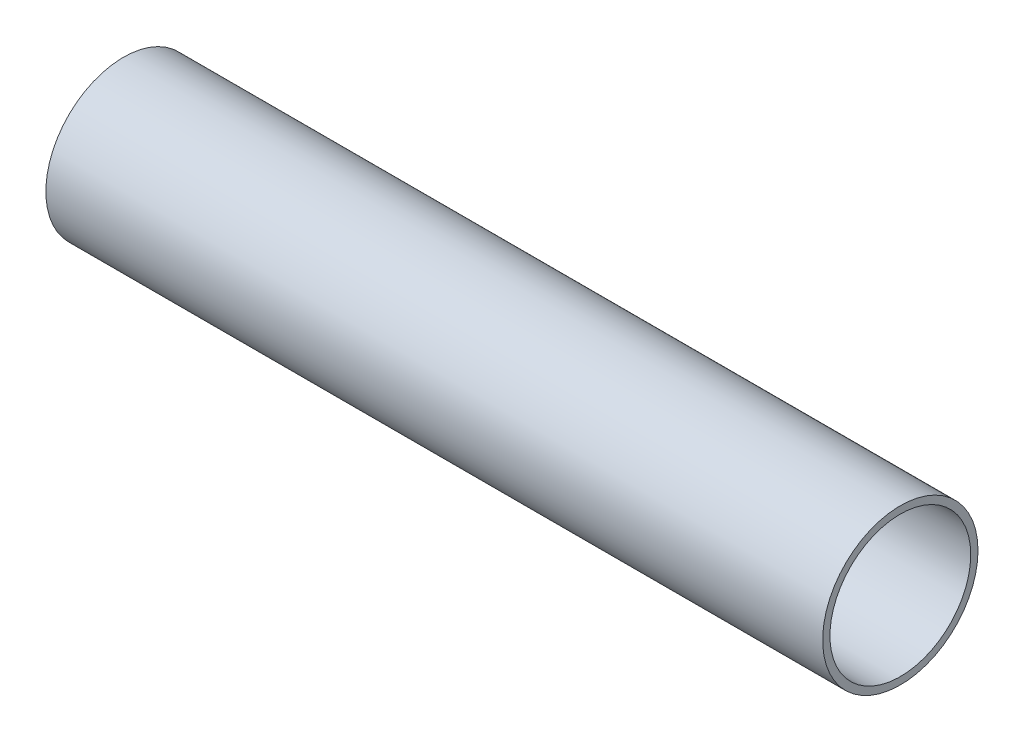
ISO-10303-21;
HEADER;
FILE_DESCRIPTION(('STEP AP214'),'2;1');
FILE_NAME('part.step','',(''),(''),'','','');
FILE_SCHEMA(('AUTOMOTIVE_DESIGN { 1 0 10303 214 1 1 1 1 }'));
ENDSEC;
DATA;
#1=APPLICATION_CONTEXT('core data for automotive mechanical design processes');
#2=APPLICATION_PROTOCOL_DEFINITION('international standard','automotive_design',2000,#1);
#3=PRODUCT_CONTEXT('',#1,'mechanical');
#4=PRODUCT('Part','Part','',(#3));
#5=PRODUCT_RELATED_PRODUCT_CATEGORY('part','',(#4));
#6=PRODUCT_DEFINITION_FORMATION('','',#4);
#7=PRODUCT_DEFINITION_CONTEXT('part definition',#1,'design');
#8=PRODUCT_DEFINITION('design','',#6,#7);
#9=PRODUCT_DEFINITION_SHAPE('','',#8);
#10=(LENGTH_UNIT() NAMED_UNIT(*) SI_UNIT(.MILLI.,.METRE.));
#11=(NAMED_UNIT(*) PLANE_ANGLE_UNIT() SI_UNIT($,.RADIAN.));
#12=(NAMED_UNIT(*) SI_UNIT($,.STERADIAN.) SOLID_ANGLE_UNIT());
#13=UNCERTAINTY_MEASURE_WITH_UNIT(LENGTH_MEASURE(1.E-05),#10,'distance_accuracy_value','');
#14=(GEOMETRIC_REPRESENTATION_CONTEXT(3) GLOBAL_UNCERTAINTY_ASSIGNED_CONTEXT((#13)) GLOBAL_UNIT_ASSIGNED_CONTEXT((#10,
#11,#12)) REPRESENTATION_CONTEXT('',''));
#15=CARTESIAN_POINT('',(0.,0.,0.));
#16=DIRECTION('',(0.,0.,1.));
#17=DIRECTION('',(1.,0.,0.));
#18=AXIS2_PLACEMENT_3D('',#15,#16,#17);
#19=CARTESIAN_POINT('',(0.,0.,0.));
#20=DIRECTION('',(1.,0.,0.));
#21=DIRECTION('',(0.,0.,-1.));
#22=AXIS2_PLACEMENT_3D('',#19,#20,#21);
#23=CYLINDRICAL_SURFACE('',#22,7.25);
#24=CARTESIAN_POINT('',(80.,0.,0.));
#25=DIRECTION('',(1.,0.,0.));
#26=DIRECTION('',(0.,0.,-1.));
#27=AXIS2_PLACEMENT_3D('',#24,#25,#26);
#28=CIRCLE('',#27,7.25);
#29=CARTESIAN_POINT('',(80.,0.,-7.25));
#30=VERTEX_POINT('',#29);
#31=EDGE_CURVE('E28',#30,#30,#28,.F.);
#32=ORIENTED_EDGE('',*,*,#31,.F.);
#33=EDGE_LOOP('',(#32));
#34=FACE_BOUND('',#33,.T.);
#35=CARTESIAN_POINT('',(0.,0.,0.));
#36=DIRECTION('',(1.,0.,0.));
#37=DIRECTION('',(0.,0.,-1.));
#38=AXIS2_PLACEMENT_3D('',#35,#36,#37);
#39=CIRCLE('',#38,7.25);
#40=CARTESIAN_POINT('',(0.,0.,-7.25));
#41=VERTEX_POINT('',#40);
#42=EDGE_CURVE('E19',#41,#41,#39,.F.);
#43=ORIENTED_EDGE('',*,*,#42,.T.);
#44=EDGE_LOOP('',(#43));
#45=FACE_BOUND('',#44,.T.);
#46=ADVANCED_FACE('F16',(#34,#45),#23,.F.);
#47=CARTESIAN_POINT('',(0.,0.,0.));
#48=DIRECTION('',(1.,0.,0.));
#49=DIRECTION('',(0.,0.,-1.));
#50=AXIS2_PLACEMENT_3D('',#47,#48,#49);
#51=PLANE('',#50);
#52=ORIENTED_EDGE('',*,*,#42,.F.);
#53=EDGE_LOOP('',(#52));
#54=FACE_BOUND('',#53,.T.);
#55=CARTESIAN_POINT('',(0.,0.,0.));
#56=DIRECTION('',(1.,0.,0.));
#57=DIRECTION('',(0.,0.,-1.));
#58=AXIS2_PLACEMENT_3D('',#55,#56,#57);
#59=CIRCLE('',#58,8.);
#60=CARTESIAN_POINT('',(0.,0.,-8.));
#61=VERTEX_POINT('',#60);
#62=EDGE_CURVE('E23',#61,#61,#59,.T.);
#63=ORIENTED_EDGE('',*,*,#62,.F.);
#64=EDGE_LOOP('',(#63));
#65=FACE_BOUND('',#64,.T.);
#66=ADVANCED_FACE('F37',(#54,#65),#51,.F.);
#67=CARTESIAN_POINT('',(80.,0.,0.));
#68=DIRECTION('',(1.,0.,0.));
#69=DIRECTION('',(0.,0.,-1.));
#70=AXIS2_PLACEMENT_3D('',#67,#68,#69);
#71=PLANE('',#70);
#72=ORIENTED_EDGE('',*,*,#31,.T.);
#73=EDGE_LOOP('',(#72));
#74=FACE_BOUND('',#73,.T.);
#75=CARTESIAN_POINT('',(80.,0.,0.));
#76=DIRECTION('',(1.,0.,0.));
#77=DIRECTION('',(0.,0.,-1.));
#78=AXIS2_PLACEMENT_3D('',#75,#76,#77);
#79=CIRCLE('',#78,8.);
#80=CARTESIAN_POINT('',(80.,0.,-8.));
#81=VERTEX_POINT('',#80);
#82=EDGE_CURVE('E10',#81,#81,#79,.F.);
#83=ORIENTED_EDGE('',*,*,#82,.F.);
#84=EDGE_LOOP('',(#83));
#85=FACE_BOUND('',#84,.T.);
#86=ADVANCED_FACE('F40',(#74,#85),#71,.T.);
#87=CARTESIAN_POINT('',(0.,0.,0.));
#88=DIRECTION('',(1.,0.,0.));
#89=DIRECTION('',(0.,0.,-1.));
#90=AXIS2_PLACEMENT_3D('',#87,#88,#89);
#91=CYLINDRICAL_SURFACE('',#90,8.);
#92=ORIENTED_EDGE('',*,*,#82,.T.);
#93=EDGE_LOOP('',(#92));
#94=FACE_BOUND('',#93,.T.);
#95=ORIENTED_EDGE('',*,*,#62,.T.);
#96=EDGE_LOOP('',(#95));
#97=FACE_BOUND('',#96,.T.);
#98=ADVANCED_FACE('F43',(#94,#97),#91,.T.);
#99=CLOSED_SHELL('',(#46,#66,#86,#98));
#100=MANIFOLD_SOLID_BREP('B1',#99);
#101=ADVANCED_BREP_SHAPE_REPRESENTATION('',(#18,#100),#14);
#102=SHAPE_DEFINITION_REPRESENTATION(#9,#101);
ENDSEC;
END-ISO-10303-21;
